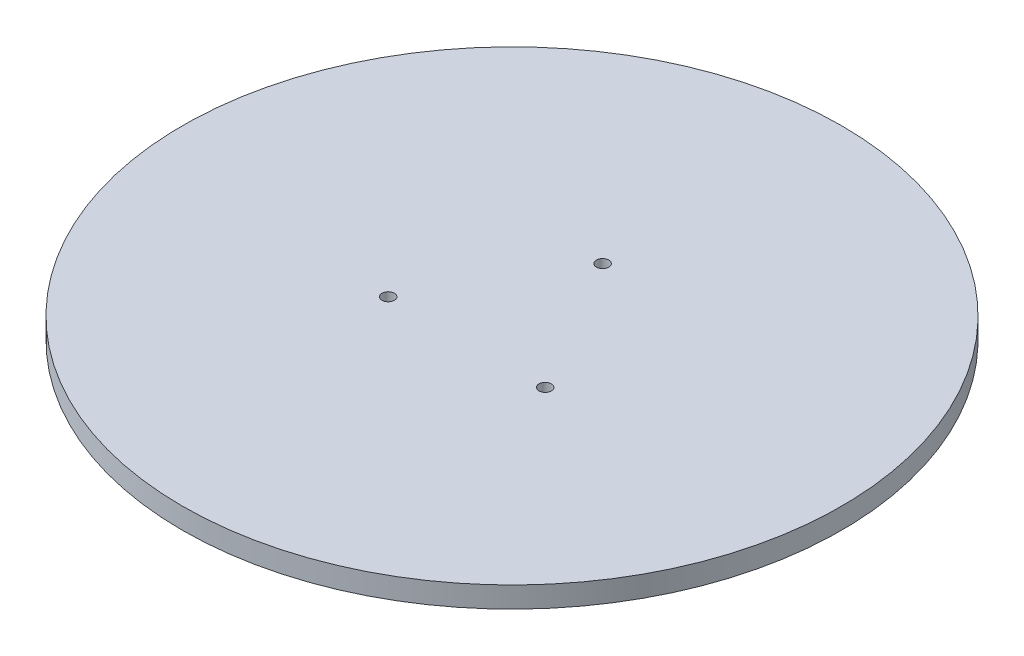
ISO-10303-21;
HEADER;
FILE_DESCRIPTION(('STEP AP214'),'2;1');
FILE_NAME('part.step','',(''),(''),'','','');
FILE_SCHEMA(('AUTOMOTIVE_DESIGN { 1 0 10303 214 1 1 1 1 }'));
ENDSEC;
DATA;
#1=APPLICATION_CONTEXT('core data for automotive mechanical design processes');
#2=APPLICATION_PROTOCOL_DEFINITION('international standard','automotive_design',2000,#1);
#3=PRODUCT_CONTEXT('',#1,'mechanical');
#4=PRODUCT('Part','Part','',(#3));
#5=PRODUCT_RELATED_PRODUCT_CATEGORY('part','',(#4));
#6=PRODUCT_DEFINITION_FORMATION('','',#4);
#7=PRODUCT_DEFINITION_CONTEXT('part definition',#1,'design');
#8=PRODUCT_DEFINITION('design','',#6,#7);
#9=PRODUCT_DEFINITION_SHAPE('','',#8);
#10=(LENGTH_UNIT() NAMED_UNIT(*) SI_UNIT(.MILLI.,.METRE.));
#11=(NAMED_UNIT(*) PLANE_ANGLE_UNIT() SI_UNIT($,.RADIAN.));
#12=(NAMED_UNIT(*) SI_UNIT($,.STERADIAN.) SOLID_ANGLE_UNIT());
#13=UNCERTAINTY_MEASURE_WITH_UNIT(LENGTH_MEASURE(1.E-05),#10,'distance_accuracy_value','');
#14=(GEOMETRIC_REPRESENTATION_CONTEXT(3) GLOBAL_UNCERTAINTY_ASSIGNED_CONTEXT((#13)) GLOBAL_UNIT_ASSIGNED_CONTEXT((#10,
#11,#12)) REPRESENTATION_CONTEXT('',''));
#15=CARTESIAN_POINT('',(0.,0.,0.));
#16=DIRECTION('',(0.,0.,1.));
#17=DIRECTION('',(1.,0.,0.));
#18=AXIS2_PLACEMENT_3D('',#15,#16,#17);
#19=CARTESIAN_POINT('',(0.,0.,0.));
#20=DIRECTION('',(0.,1.,0.));
#21=DIRECTION('',(0.,0.,1.));
#22=AXIS2_PLACEMENT_3D('',#19,#20,#21);
#23=PLANE('',#22);
#24=CARTESIAN_POINT('',(0.,0.,-11.));
#25=DIRECTION('',(0.,1.,0.));
#26=DIRECTION('',(0.,0.,1.));
#27=AXIS2_PLACEMENT_3D('',#24,#25,#26);
#28=CIRCLE('',#27,0.750000000000001);
#29=CARTESIAN_POINT('',(0.,0.,-10.25));
#30=VERTEX_POINT('',#29);
#31=EDGE_CURVE('E51',#30,#30,#28,.T.);
#32=ORIENTED_EDGE('',*,*,#31,.T.);
#33=EDGE_LOOP('',(#32));
#34=FACE_BOUND('',#33,.T.);
#35=CARTESIAN_POINT('',(9.52627944162948,0.,5.49999999999962));
#36=DIRECTION('',(0.,1.,0.));
#37=DIRECTION('',(0.,0.,1.));
#38=AXIS2_PLACEMENT_3D('',#35,#36,#37);
#39=CIRCLE('',#38,0.75);
#40=CARTESIAN_POINT('',(9.52627944162948,0.,6.24999999999962));
#41=VERTEX_POINT('',#40);
#42=EDGE_CURVE('E59',#41,#41,#39,.T.);
#43=ORIENTED_EDGE('',*,*,#42,.T.);
#44=EDGE_LOOP('',(#43));
#45=FACE_BOUND('',#44,.T.);
#46=CARTESIAN_POINT('',(-9.52627944162817,0.,5.50000000000038));
#47=DIRECTION('',(0.,1.,0.));
#48=DIRECTION('',(0.,0.,1.));
#49=AXIS2_PLACEMENT_3D('',#46,#47,#48);
#50=CIRCLE('',#49,0.75);
#51=CARTESIAN_POINT('',(-9.52627944162817,0.,6.25000000000038));
#52=VERTEX_POINT('',#51);
#53=EDGE_CURVE('E62',#52,#52,#50,.T.);
#54=ORIENTED_EDGE('',*,*,#53,.T.);
#55=EDGE_LOOP('',(#54));
#56=FACE_BOUND('',#55,.T.);
#57=CARTESIAN_POINT('',(0.,0.,0.));
#58=DIRECTION('',(0.,-1.,0.));
#59=DIRECTION('',(0.,0.,-1.));
#60=AXIS2_PLACEMENT_3D('',#57,#58,#59);
#61=CIRCLE('',#60,26.6999999999999);
#62=CARTESIAN_POINT('',(0.,0.,-26.6999999999999));
#63=VERTEX_POINT('',#62);
#64=EDGE_CURVE('E77',#63,#63,#61,.T.);
#65=ORIENTED_EDGE('',*,*,#64,.T.);
#66=EDGE_LOOP('',(#65));
#67=FACE_BOUND('',#66,.T.);
#68=ADVANCED_FACE('F35',(#34,#45,#56,#67),#23,.F.);
#69=CARTESIAN_POINT('',(0.,2.54,0.));
#70=DIRECTION('',(0.,-1.,0.));
#71=DIRECTION('',(0.,0.,-1.));
#72=AXIS2_PLACEMENT_3D('',#69,#70,#71);
#73=CYLINDRICAL_SURFACE('',#72,40.);
#74=CARTESIAN_POINT('',(0.,2.54,0.));
#75=DIRECTION('',(0.,1.,0.));
#76=DIRECTION('',(0.,0.,1.));
#77=AXIS2_PLACEMENT_3D('',#74,#75,#76);
#78=CIRCLE('',#77,40.);
#79=CARTESIAN_POINT('',(0.,2.54,40.));
#80=VERTEX_POINT('',#79);
#81=EDGE_CURVE('E42',#80,#80,#78,.T.);
#82=ORIENTED_EDGE('',*,*,#81,.F.);
#83=EDGE_LOOP('',(#82));
#84=FACE_BOUND('',#83,.T.);
#85=CARTESIAN_POINT('',(0.,0.,0.));
#86=DIRECTION('',(0.,1.,0.));
#87=DIRECTION('',(0.,0.,1.));
#88=AXIS2_PLACEMENT_3D('',#85,#86,#87);
#89=CIRCLE('',#88,40.);
#90=CARTESIAN_POINT('',(0.,0.,40.));
#91=VERTEX_POINT('',#90);
#92=EDGE_CURVE('E46',#91,#91,#89,.T.);
#93=ORIENTED_EDGE('',*,*,#92,.T.);
#94=EDGE_LOOP('',(#93));
#95=FACE_BOUND('',#94,.T.);
#96=ADVANCED_FACE('F37',(#84,#95),#73,.T.);
#97=CARTESIAN_POINT('',(0.,2.54,0.));
#98=DIRECTION('',(0.,1.,0.));
#99=DIRECTION('',(0.,0.,1.));
#100=AXIS2_PLACEMENT_3D('',#97,#98,#99);
#101=PLANE('',#100);
#102=CARTESIAN_POINT('',(-9.52627944162817,2.54,5.50000000000038));
#103=DIRECTION('',(0.,1.,0.));
#104=DIRECTION('',(0.,0.,1.));
#105=AXIS2_PLACEMENT_3D('',#102,#103,#104);
#106=CIRCLE('',#105,0.75);
#107=CARTESIAN_POINT('',(-9.52627944162817,2.54,6.25000000000038));
#108=VERTEX_POINT('',#107);
#109=EDGE_CURVE('E64',#108,#108,#106,.T.);
#110=ORIENTED_EDGE('',*,*,#109,.F.);
#111=EDGE_LOOP('',(#110));
#112=FACE_BOUND('',#111,.T.);
#113=CARTESIAN_POINT('',(9.52627944162948,2.54,5.49999999999962));
#114=DIRECTION('',(0.,1.,0.));
#115=DIRECTION('',(0.,0.,1.));
#116=AXIS2_PLACEMENT_3D('',#113,#114,#115);
#117=CIRCLE('',#116,0.75);
#118=CARTESIAN_POINT('',(9.52627944162948,2.54,6.24999999999962));
#119=VERTEX_POINT('',#118);
#120=EDGE_CURVE('E61',#119,#119,#117,.T.);
#121=ORIENTED_EDGE('',*,*,#120,.F.);
#122=EDGE_LOOP('',(#121));
#123=FACE_BOUND('',#122,.T.);
#124=CARTESIAN_POINT('',(0.,2.54,-11.));
#125=DIRECTION('',(0.,1.,0.));
#126=DIRECTION('',(0.,0.,1.));
#127=AXIS2_PLACEMENT_3D('',#124,#125,#126);
#128=CIRCLE('',#127,0.750000000000001);
#129=CARTESIAN_POINT('',(0.,2.54,-10.25));
#130=VERTEX_POINT('',#129);
#131=EDGE_CURVE('E54',#130,#130,#128,.T.);
#132=ORIENTED_EDGE('',*,*,#131,.F.);
#133=EDGE_LOOP('',(#132));
#134=FACE_BOUND('',#133,.T.);
#135=ORIENTED_EDGE('',*,*,#81,.T.);
#136=EDGE_LOOP('',(#135));
#137=FACE_BOUND('',#136,.T.);
#138=ADVANCED_FACE('F107',(#112,#123,#134,#137),#101,.T.);
#139=CARTESIAN_POINT('',(0.,0.,0.));
#140=DIRECTION('',(0.,1.,0.));
#141=DIRECTION('',(0.,0.,1.));
#142=AXIS2_PLACEMENT_3D('',#139,#140,#141);
#143=CIRCLE('',#142,30.6999999999999);
#144=CARTESIAN_POINT('',(0.,0.,30.6999999999999));
#145=VERTEX_POINT('',#144);
#146=EDGE_CURVE('E10',#145,#145,#143,.F.);
#147=ORIENTED_EDGE('',*,*,#146,.F.);
#148=EDGE_LOOP('',(#147));
#149=FACE_BOUND('',#148,.T.);
#150=ORIENTED_EDGE('',*,*,#92,.F.);
#151=EDGE_LOOP('',(#150));
#152=FACE_BOUND('',#151,.T.);
#153=ADVANCED_FACE('F103',(#149,#152),#23,.F.);
#154=CARTESIAN_POINT('',(0.,-7.46,-11.));
#155=DIRECTION('',(0.,1.,0.));
#156=DIRECTION('',(0.,0.,1.));
#157=AXIS2_PLACEMENT_3D('',#154,#155,#156);
#158=CYLINDRICAL_SURFACE('',#157,0.750000000000001);
#159=ORIENTED_EDGE('',*,*,#131,.T.);
#160=EDGE_LOOP('',(#159));
#161=FACE_BOUND('',#160,.T.);
#162=ORIENTED_EDGE('',*,*,#31,.F.);
#163=EDGE_LOOP('',(#162));
#164=FACE_BOUND('',#163,.T.);
#165=ADVANCED_FACE('F112',(#161,#164),#158,.F.);
#166=CARTESIAN_POINT('',(9.52627944162948,-7.46,5.49999999999962));
#167=DIRECTION('',(0.,1.,0.));
#168=DIRECTION('',(0.,0.,1.));
#169=AXIS2_PLACEMENT_3D('',#166,#167,#168);
#170=CYLINDRICAL_SURFACE('',#169,0.75);
#171=ORIENTED_EDGE('',*,*,#120,.T.);
#172=EDGE_LOOP('',(#171));
#173=FACE_BOUND('',#172,.T.);
#174=ORIENTED_EDGE('',*,*,#42,.F.);
#175=EDGE_LOOP('',(#174));
#176=FACE_BOUND('',#175,.T.);
#177=ADVANCED_FACE('F98',(#173,#176),#170,.F.);
#178=CARTESIAN_POINT('',(-9.52627944162817,-7.46,5.50000000000038));
#179=DIRECTION('',(0.,1.,0.));
#180=DIRECTION('',(0.,0.,1.));
#181=AXIS2_PLACEMENT_3D('',#178,#179,#180);
#182=CYLINDRICAL_SURFACE('',#181,0.75);
#183=ORIENTED_EDGE('',*,*,#109,.T.);
#184=EDGE_LOOP('',(#183));
#185=FACE_BOUND('',#184,.T.);
#186=ORIENTED_EDGE('',*,*,#53,.F.);
#187=EDGE_LOOP('',(#186));
#188=FACE_BOUND('',#187,.T.);
#189=ADVANCED_FACE('F89',(#185,#188),#182,.F.);
#190=CARTESIAN_POINT('',(0.,-0.254,0.));
#191=DIRECTION('',(0.,-1.,0.));
#192=DIRECTION('',(0.,0.,-1.));
#193=AXIS2_PLACEMENT_3D('',#190,#191,#192);
#194=PLANE('',#193);
#195=CARTESIAN_POINT('',(0.,-0.254,0.));
#196=DIRECTION('',(0.,-1.,0.));
#197=DIRECTION('',(0.,0.,-1.));
#198=AXIS2_PLACEMENT_3D('',#195,#196,#197);
#199=CIRCLE('',#198,30.6999999999999);
#200=CARTESIAN_POINT('',(0.,-0.254,-30.6999999999999));
#201=VERTEX_POINT('',#200);
#202=EDGE_CURVE('E69',#201,#201,#199,.T.);
#203=ORIENTED_EDGE('',*,*,#202,.T.);
#204=EDGE_LOOP('',(#203));
#205=FACE_BOUND('',#204,.T.);
#206=CARTESIAN_POINT('',(0.,-0.254,0.));
#207=DIRECTION('',(0.,-1.,0.));
#208=DIRECTION('',(0.,0.,-1.));
#209=AXIS2_PLACEMENT_3D('',#206,#207,#208);
#210=CIRCLE('',#209,26.6999999999999);
#211=CARTESIAN_POINT('',(0.,-0.254,-26.6999999999999));
#212=VERTEX_POINT('',#211);
#213=EDGE_CURVE('E74',#212,#212,#210,.T.);
#214=ORIENTED_EDGE('',*,*,#213,.F.);
#215=EDGE_LOOP('',(#214));
#216=FACE_BOUND('',#215,.T.);
#217=ADVANCED_FACE('F86',(#205,#216),#194,.T.);
#218=CARTESIAN_POINT('',(0.,-0.254,0.));
#219=DIRECTION('',(0.,1.,0.));
#220=DIRECTION('',(0.,0.,1.));
#221=AXIS2_PLACEMENT_3D('',#218,#219,#220);
#222=CYLINDRICAL_SURFACE('',#221,30.6999999999999);
#223=ORIENTED_EDGE('',*,*,#202,.F.);
#224=EDGE_LOOP('',(#223));
#225=FACE_BOUND('',#224,.T.);
#226=ORIENTED_EDGE('',*,*,#146,.T.);
#227=EDGE_LOOP('',(#226));
#228=FACE_BOUND('',#227,.T.);
#229=ADVANCED_FACE('F88',(#225,#228),#222,.T.);
#230=CARTESIAN_POINT('',(0.,-0.254,0.));
#231=DIRECTION('',(0.,1.,0.));
#232=DIRECTION('',(0.,0.,1.));
#233=AXIS2_PLACEMENT_3D('',#230,#231,#232);
#234=CYLINDRICAL_SURFACE('',#233,26.6999999999999);
#235=ORIENTED_EDGE('',*,*,#213,.T.);
#236=EDGE_LOOP('',(#235));
#237=FACE_BOUND('',#236,.T.);
#238=ORIENTED_EDGE('',*,*,#64,.F.);
#239=EDGE_LOOP('',(#238));
#240=FACE_BOUND('',#239,.T.);
#241=ADVANCED_FACE('F83',(#237,#240),#234,.F.);
#242=CLOSED_SHELL('',(#68,#96,#138,#153,#165,#177,#189,#217,#229,#241));
#243=MANIFOLD_SOLID_BREP('B2',#242);
#244=ADVANCED_BREP_SHAPE_REPRESENTATION('',(#18,#243),#14);
#245=SHAPE_DEFINITION_REPRESENTATION(#9,#244);
ENDSEC;
END-ISO-10303-21;
